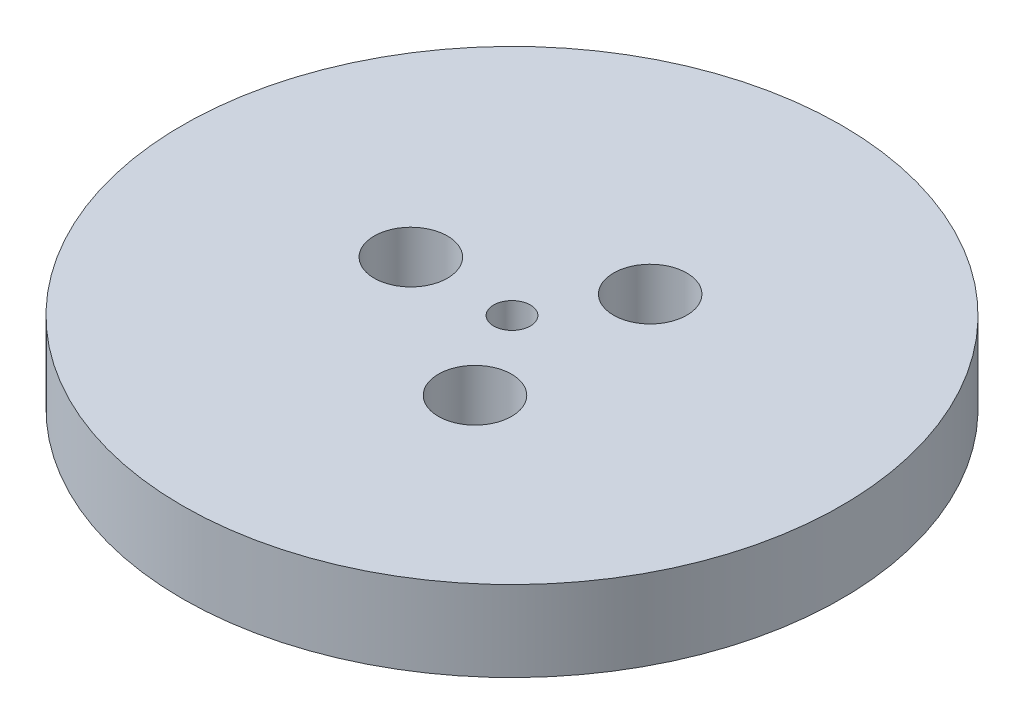
ISO-10303-21;
HEADER;
FILE_DESCRIPTION(('STEP AP214'),'2;1');
FILE_NAME('part.step','',(''),(''),'','','');
FILE_SCHEMA(('AUTOMOTIVE_DESIGN { 1 0 10303 214 1 1 1 1 }'));
ENDSEC;
DATA;
#1=APPLICATION_CONTEXT('core data for automotive mechanical design processes');
#2=APPLICATION_PROTOCOL_DEFINITION('international standard','automotive_design',2000,#1);
#3=PRODUCT_CONTEXT('',#1,'mechanical');
#4=PRODUCT('Part','Part','',(#3));
#5=PRODUCT_RELATED_PRODUCT_CATEGORY('part','',(#4));
#6=PRODUCT_DEFINITION_FORMATION('','',#4);
#7=PRODUCT_DEFINITION_CONTEXT('part definition',#1,'design');
#8=PRODUCT_DEFINITION('design','',#6,#7);
#9=PRODUCT_DEFINITION_SHAPE('','',#8);
#10=(LENGTH_UNIT() NAMED_UNIT(*) SI_UNIT(.MILLI.,.METRE.));
#11=(NAMED_UNIT(*) PLANE_ANGLE_UNIT() SI_UNIT($,.RADIAN.));
#12=(NAMED_UNIT(*) SI_UNIT($,.STERADIAN.) SOLID_ANGLE_UNIT());
#13=UNCERTAINTY_MEASURE_WITH_UNIT(LENGTH_MEASURE(1.E-05),#10,'distance_accuracy_value','');
#14=(GEOMETRIC_REPRESENTATION_CONTEXT(3) GLOBAL_UNCERTAINTY_ASSIGNED_CONTEXT((#13)) GLOBAL_UNIT_ASSIGNED_CONTEXT((#10,
#11,#12)) REPRESENTATION_CONTEXT('',''));
#15=CARTESIAN_POINT('',(0.,0.,0.));
#16=DIRECTION('',(0.,0.,1.));
#17=DIRECTION('',(1.,0.,0.));
#18=AXIS2_PLACEMENT_3D('',#15,#16,#17);
#19=CARTESIAN_POINT('',(0.,22.,0.));
#20=DIRECTION('',(0.,-1.,0.));
#21=DIRECTION('',(0.,0.,-1.));
#22=AXIS2_PLACEMENT_3D('',#19,#20,#21);
#23=CYLINDRICAL_SURFACE('',#22,90.);
#24=CARTESIAN_POINT('',(0.,22.,0.));
#25=DIRECTION('',(0.,1.,0.));
#26=DIRECTION('',(0.,0.,1.));
#27=AXIS2_PLACEMENT_3D('',#24,#25,#26);
#28=CIRCLE('',#27,90.);
#29=CARTESIAN_POINT('',(0.,22.,90.));
#30=VERTEX_POINT('',#29);
#31=EDGE_CURVE('E10',#30,#30,#28,.T.);
#32=ORIENTED_EDGE('',*,*,#31,.F.);
#33=EDGE_LOOP('',(#32));
#34=FACE_BOUND('',#33,.T.);
#35=CARTESIAN_POINT('',(0.,0.,0.));
#36=DIRECTION('',(0.,1.,0.));
#37=DIRECTION('',(0.,0.,1.));
#38=AXIS2_PLACEMENT_3D('',#35,#36,#37);
#39=CIRCLE('',#38,90.);
#40=CARTESIAN_POINT('',(0.,0.,90.));
#41=VERTEX_POINT('',#40);
#42=EDGE_CURVE('E37',#41,#41,#39,.T.);
#43=ORIENTED_EDGE('',*,*,#42,.T.);
#44=EDGE_LOOP('',(#43));
#45=FACE_BOUND('',#44,.T.);
#46=ADVANCED_FACE('F40',(#34,#45),#23,.T.);
#47=CARTESIAN_POINT('',(0.,22.,0.));
#48=DIRECTION('',(0.,1.,0.));
#49=DIRECTION('',(0.,0.,1.));
#50=AXIS2_PLACEMENT_3D('',#47,#48,#49);
#51=PLANE('',#50);
#52=CARTESIAN_POINT('',(13.8120078680391,22.,23.9230993819846));
#53=DIRECTION('',(0.,1.,0.));
#54=DIRECTION('',(0.866025403784436,0.,-0.500000000000004));
#55=AXIS2_PLACEMENT_3D('',#52,#53,#54);
#56=CIRCLE('',#55,10.);
#57=CARTESIAN_POINT('',(22.4722619058835,22.,18.9230993819846));
#58=VERTEX_POINT('',#57);
#59=EDGE_CURVE('E70',#58,#58,#56,.T.);
#60=ORIENTED_EDGE('',*,*,#59,.F.);
#61=EDGE_LOOP('',(#60));
#62=FACE_BOUND('',#61,.T.);
#63=CARTESIAN_POINT('',(13.8120078680388,22.,-23.9230993819848));
#64=DIRECTION('',(0.,1.,0.));
#65=DIRECTION('',(-0.866025403784443,0.,-0.499999999999992));
#66=AXIS2_PLACEMENT_3D('',#63,#64,#65);
#67=CIRCLE('',#66,10.);
#68=CARTESIAN_POINT('',(5.15175383019437,22.,-28.9230993819847));
#69=VERTEX_POINT('',#68);
#70=EDGE_CURVE('E61',#69,#69,#67,.T.);
#71=ORIENTED_EDGE('',*,*,#70,.F.);
#72=EDGE_LOOP('',(#71));
#73=FACE_BOUND('',#72,.T.);
#74=CARTESIAN_POINT('',(-27.624015736078,22.,0.));
#75=DIRECTION('',(0.,1.,0.));
#76=DIRECTION('',(0.,0.,1.));
#77=AXIS2_PLACEMENT_3D('',#74,#75,#76);
#78=CIRCLE('',#77,10.);
#79=CARTESIAN_POINT('',(-27.624015736078,22.,10.));
#80=VERTEX_POINT('',#79);
#81=EDGE_CURVE('E54',#80,#80,#78,.T.);
#82=ORIENTED_EDGE('',*,*,#81,.F.);
#83=EDGE_LOOP('',(#82));
#84=FACE_BOUND('',#83,.T.);
#85=CARTESIAN_POINT('',(0.,22.,0.));
#86=DIRECTION('',(0.,1.,0.));
#87=DIRECTION('',(0.,0.,1.));
#88=AXIS2_PLACEMENT_3D('',#85,#86,#87);
#89=CIRCLE('',#88,5.);
#90=CARTESIAN_POINT('',(0.,22.,5.));
#91=VERTEX_POINT('',#90);
#92=EDGE_CURVE('E50',#91,#91,#89,.T.);
#93=ORIENTED_EDGE('',*,*,#92,.F.);
#94=EDGE_LOOP('',(#93));
#95=FACE_BOUND('',#94,.T.);
#96=ORIENTED_EDGE('',*,*,#31,.T.);
#97=EDGE_LOOP('',(#96));
#98=FACE_BOUND('',#97,.T.);
#99=ADVANCED_FACE('F85',(#62,#73,#84,#95,#98),#51,.T.);
#100=CARTESIAN_POINT('',(0.,0.,0.));
#101=DIRECTION('',(0.,1.,0.));
#102=DIRECTION('',(0.,0.,1.));
#103=AXIS2_PLACEMENT_3D('',#100,#101,#102);
#104=PLANE('',#103);
#105=CARTESIAN_POINT('',(0.,0.,0.));
#106=DIRECTION('',(0.,1.,0.));
#107=DIRECTION('',(0.,0.,1.));
#108=AXIS2_PLACEMENT_3D('',#105,#106,#107);
#109=CIRCLE('',#108,5.);
#110=CARTESIAN_POINT('',(0.,0.,5.));
#111=VERTEX_POINT('',#110);
#112=EDGE_CURVE('E47',#111,#111,#109,.T.);
#113=ORIENTED_EDGE('',*,*,#112,.T.);
#114=EDGE_LOOP('',(#113));
#115=FACE_BOUND('',#114,.T.);
#116=ORIENTED_EDGE('',*,*,#42,.F.);
#117=EDGE_LOOP('',(#116));
#118=FACE_BOUND('',#117,.T.);
#119=ADVANCED_FACE('F84',(#115,#118),#104,.F.);
#120=CARTESIAN_POINT('',(0.,22.,0.));
#121=DIRECTION('',(0.,-1.,0.));
#122=DIRECTION('',(0.,0.,-1.));
#123=AXIS2_PLACEMENT_3D('',#120,#121,#122);
#124=CYLINDRICAL_SURFACE('',#123,5.);
#125=ORIENTED_EDGE('',*,*,#92,.T.);
#126=EDGE_LOOP('',(#125));
#127=FACE_BOUND('',#126,.T.);
#128=ORIENTED_EDGE('',*,*,#112,.F.);
#129=EDGE_LOOP('',(#128));
#130=FACE_BOUND('',#129,.T.);
#131=ADVANCED_FACE('F91',(#127,#130),#124,.F.);
#132=CARTESIAN_POINT('',(-27.624015736078,2.16624738306351,0.));
#133=DIRECTION('',(0.,1.,0.));
#134=DIRECTION('',(0.,0.,1.));
#135=AXIS2_PLACEMENT_3D('',#132,#133,#134);
#136=CYLINDRICAL_SURFACE('',#135,10.);
#137=CARTESIAN_POINT('',(-27.624015736078,2.16624738306351,0.));
#138=DIRECTION('',(0.,1.,0.));
#139=DIRECTION('',(0.,0.,1.));
#140=AXIS2_PLACEMENT_3D('',#137,#138,#139);
#141=CIRCLE('',#140,10.);
#142=CARTESIAN_POINT('',(-27.624015736078,2.16624738306351,10.));
#143=VERTEX_POINT('',#142);
#144=EDGE_CURVE('E55',#143,#143,#141,.T.);
#145=ORIENTED_EDGE('',*,*,#144,.F.);
#146=EDGE_LOOP('',(#145));
#147=FACE_BOUND('',#146,.T.);
#148=ORIENTED_EDGE('',*,*,#81,.T.);
#149=EDGE_LOOP('',(#148));
#150=FACE_BOUND('',#149,.T.);
#151=ADVANCED_FACE('F96',(#147,#150),#136,.F.);
#152=CARTESIAN_POINT('',(-27.624015736078,2.16624738306351,0.));
#153=DIRECTION('',(0.,1.,0.));
#154=DIRECTION('',(0.,0.,1.));
#155=AXIS2_PLACEMENT_3D('',#152,#153,#154);
#156=PLANE('',#155);
#157=ORIENTED_EDGE('',*,*,#144,.T.);
#158=EDGE_LOOP('',(#157));
#159=FACE_BOUND('',#158,.T.);
#160=ADVANCED_FACE('F127',(#159),#156,.T.);
#161=CARTESIAN_POINT('',(13.8120078680388,2.16624738306351,-23.9230993819848));
#162=DIRECTION('',(0.,1.,0.));
#163=DIRECTION('',(0.,0.,1.));
#164=AXIS2_PLACEMENT_3D('',#161,#162,#163);
#165=CYLINDRICAL_SURFACE('',#164,10.);
#166=CARTESIAN_POINT('',(13.8120078680388,2.16624738306351,-23.9230993819848));
#167=DIRECTION('',(0.,1.,0.));
#168=DIRECTION('',(-0.866025403784443,0.,-0.499999999999992));
#169=AXIS2_PLACEMENT_3D('',#166,#167,#168);
#170=CIRCLE('',#169,10.);
#171=CARTESIAN_POINT('',(5.15175383019437,2.16624738306351,-28.9230993819847));
#172=VERTEX_POINT('',#171);
#173=EDGE_CURVE('E63',#172,#172,#170,.T.);
#174=ORIENTED_EDGE('',*,*,#173,.F.);
#175=EDGE_LOOP('',(#174));
#176=FACE_BOUND('',#175,.T.);
#177=ORIENTED_EDGE('',*,*,#70,.T.);
#178=EDGE_LOOP('',(#177));
#179=FACE_BOUND('',#178,.T.);
#180=ADVANCED_FACE('F133',(#176,#179),#165,.F.);
#181=CARTESIAN_POINT('',(13.8120078680388,2.16624738306351,-23.9230993819848));
#182=DIRECTION('',(0.,1.,0.));
#183=DIRECTION('',(-0.866025403784443,0.,-0.499999999999992));
#184=AXIS2_PLACEMENT_3D('',#181,#182,#183);
#185=PLANE('',#184);
#186=ORIENTED_EDGE('',*,*,#173,.T.);
#187=EDGE_LOOP('',(#186));
#188=FACE_BOUND('',#187,.T.);
#189=ADVANCED_FACE('F77',(#188),#185,.T.);
#190=CARTESIAN_POINT('',(13.8120078680391,2.16624738306351,23.9230993819846));
#191=DIRECTION('',(0.,1.,0.));
#192=DIRECTION('',(0.,0.,1.));
#193=AXIS2_PLACEMENT_3D('',#190,#191,#192);
#194=CYLINDRICAL_SURFACE('',#193,10.);
#195=CARTESIAN_POINT('',(13.8120078680391,2.16624738306351,23.9230993819846));
#196=DIRECTION('',(0.,1.,0.));
#197=DIRECTION('',(0.866025403784436,0.,-0.500000000000004));
#198=AXIS2_PLACEMENT_3D('',#195,#196,#197);
#199=CIRCLE('',#198,10.);
#200=CARTESIAN_POINT('',(22.4722619058835,2.16624738306351,18.9230993819846));
#201=VERTEX_POINT('',#200);
#202=EDGE_CURVE('E59',#201,#201,#199,.T.);
#203=ORIENTED_EDGE('',*,*,#202,.F.);
#204=EDGE_LOOP('',(#203));
#205=FACE_BOUND('',#204,.T.);
#206=ORIENTED_EDGE('',*,*,#59,.T.);
#207=EDGE_LOOP('',(#206));
#208=FACE_BOUND('',#207,.T.);
#209=ADVANCED_FACE('F73',(#205,#208),#194,.F.);
#210=CARTESIAN_POINT('',(13.8120078680391,2.16624738306351,23.9230993819846));
#211=DIRECTION('',(0.,1.,0.));
#212=DIRECTION('',(0.866025403784436,0.,-0.500000000000004));
#213=AXIS2_PLACEMENT_3D('',#210,#211,#212);
#214=PLANE('',#213);
#215=ORIENTED_EDGE('',*,*,#202,.T.);
#216=EDGE_LOOP('',(#215));
#217=FACE_BOUND('',#216,.T.);
#218=ADVANCED_FACE('F71',(#217),#214,.T.);
#219=CLOSED_SHELL('',(#46,#99,#119,#131,#151,#160,#180,#189,#209,#218));
#220=MANIFOLD_SOLID_BREP('B2',#219);
#221=ADVANCED_BREP_SHAPE_REPRESENTATION('',(#18,#220),#14);
#222=SHAPE_DEFINITION_REPRESENTATION(#9,#221);
ENDSEC;
END-ISO-10303-21;
